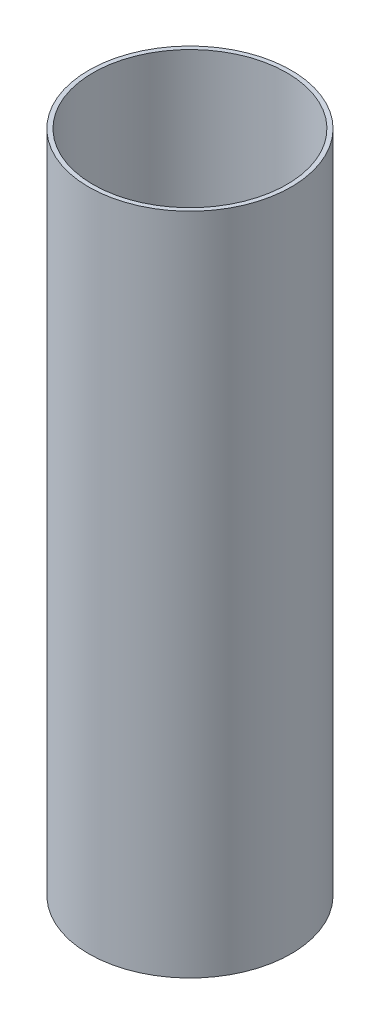
ISO-10303-21;
HEADER;
FILE_DESCRIPTION(('STEP AP214'),'2;1');
FILE_NAME('part.step','',(''),(''),'','','');
FILE_SCHEMA(('AUTOMOTIVE_DESIGN { 1 0 10303 214 1 1 1 1 }'));
ENDSEC;
DATA;
#1=APPLICATION_CONTEXT('core data for automotive mechanical design processes');
#2=APPLICATION_PROTOCOL_DEFINITION('international standard','automotive_design',2000,#1);
#3=PRODUCT_CONTEXT('',#1,'mechanical');
#4=PRODUCT('Part','Part','',(#3));
#5=PRODUCT_RELATED_PRODUCT_CATEGORY('part','',(#4));
#6=PRODUCT_DEFINITION_FORMATION('','',#4);
#7=PRODUCT_DEFINITION_CONTEXT('part definition',#1,'design');
#8=PRODUCT_DEFINITION('design','',#6,#7);
#9=PRODUCT_DEFINITION_SHAPE('','',#8);
#10=(LENGTH_UNIT() NAMED_UNIT(*) SI_UNIT(.MILLI.,.METRE.));
#11=(NAMED_UNIT(*) PLANE_ANGLE_UNIT() SI_UNIT($,.RADIAN.));
#12=(NAMED_UNIT(*) SI_UNIT($,.STERADIAN.) SOLID_ANGLE_UNIT());
#13=UNCERTAINTY_MEASURE_WITH_UNIT(LENGTH_MEASURE(1.E-05),#10,'distance_accuracy_value','');
#14=(GEOMETRIC_REPRESENTATION_CONTEXT(3) GLOBAL_UNCERTAINTY_ASSIGNED_CONTEXT((#13)) GLOBAL_UNIT_ASSIGNED_CONTEXT((#10,
#11,#12)) REPRESENTATION_CONTEXT('',''));
#15=CARTESIAN_POINT('',(0.,0.,0.));
#16=DIRECTION('',(0.,0.,1.));
#17=DIRECTION('',(1.,0.,0.));
#18=AXIS2_PLACEMENT_3D('',#15,#16,#17);
#19=CARTESIAN_POINT('',(0.,500.,0.));
#20=DIRECTION('',(0.,1.,0.));
#21=DIRECTION('',(0.,0.,1.));
#22=AXIS2_PLACEMENT_3D('',#19,#20,#21);
#23=PLANE('',#22);
#24=CARTESIAN_POINT('',(0.,500.,0.));
#25=DIRECTION('',(0.,1.,0.));
#26=DIRECTION('',(0.,0.,1.));
#27=AXIS2_PLACEMENT_3D('',#24,#25,#26);
#28=CIRCLE('',#27,76.2);
#29=CARTESIAN_POINT('',(0.,500.,76.2));
#30=VERTEX_POINT('',#29);
#31=EDGE_CURVE('E10',#30,#30,#28,.T.);
#32=ORIENTED_EDGE('',*,*,#31,.T.);
#33=EDGE_LOOP('',(#32));
#34=FACE_BOUND('',#33,.T.);
#35=CARTESIAN_POINT('',(0.,500.,0.));
#36=DIRECTION('',(0.,1.,0.));
#37=DIRECTION('',(0.,0.,1.));
#38=AXIS2_PLACEMENT_3D('',#35,#36,#37);
#39=CIRCLE('',#38,72.95);
#40=CARTESIAN_POINT('',(0.,500.,72.95));
#41=VERTEX_POINT('',#40);
#42=EDGE_CURVE('E56',#41,#41,#39,.T.);
#43=ORIENTED_EDGE('',*,*,#42,.F.);
#44=EDGE_LOOP('',(#43));
#45=FACE_BOUND('',#44,.T.);
#46=ADVANCED_FACE('F43',(#34,#45),#23,.T.);
#47=CARTESIAN_POINT('',(0.,0.,0.));
#48=DIRECTION('',(0.,1.,0.));
#49=DIRECTION('',(0.,0.,1.));
#50=AXIS2_PLACEMENT_3D('',#47,#48,#49);
#51=PLANE('',#50);
#52=CARTESIAN_POINT('',(0.,0.,0.));
#53=DIRECTION('',(0.,1.,0.));
#54=DIRECTION('',(0.,0.,1.));
#55=AXIS2_PLACEMENT_3D('',#52,#53,#54);
#56=CIRCLE('',#55,76.2);
#57=CARTESIAN_POINT('',(0.,0.,76.2));
#58=VERTEX_POINT('',#57);
#59=EDGE_CURVE('E47',#58,#58,#56,.T.);
#60=ORIENTED_EDGE('',*,*,#59,.F.);
#61=EDGE_LOOP('',(#60));
#62=FACE_BOUND('',#61,.T.);
#63=CARTESIAN_POINT('',(0.,0.,0.));
#64=DIRECTION('',(0.,1.,0.));
#65=DIRECTION('',(0.,0.,1.));
#66=AXIS2_PLACEMENT_3D('',#63,#64,#65);
#67=CIRCLE('',#66,72.95);
#68=CARTESIAN_POINT('',(0.,0.,72.95));
#69=VERTEX_POINT('',#68);
#70=EDGE_CURVE('E58',#69,#69,#67,.T.);
#71=ORIENTED_EDGE('',*,*,#70,.T.);
#72=EDGE_LOOP('',(#71));
#73=FACE_BOUND('',#72,.T.);
#74=ADVANCED_FACE('F70',(#62,#73),#51,.F.);
#75=CARTESIAN_POINT('',(0.,500.,0.));
#76=DIRECTION('',(0.,-1.,0.));
#77=DIRECTION('',(0.,0.,-1.));
#78=AXIS2_PLACEMENT_3D('',#75,#76,#77);
#79=CYLINDRICAL_SURFACE('',#78,76.2);
#80=ORIENTED_EDGE('',*,*,#31,.F.);
#81=EDGE_LOOP('',(#80));
#82=FACE_BOUND('',#81,.T.);
#83=ORIENTED_EDGE('',*,*,#59,.T.);
#84=EDGE_LOOP('',(#83));
#85=FACE_BOUND('',#84,.T.);
#86=ADVANCED_FACE('F45',(#82,#85),#79,.T.);
#87=CARTESIAN_POINT('',(0.,500.,0.));
#88=DIRECTION('',(0.,-1.,0.));
#89=DIRECTION('',(0.,0.,-1.));
#90=AXIS2_PLACEMENT_3D('',#87,#88,#89);
#91=CYLINDRICAL_SURFACE('',#90,72.95);
#92=ORIENTED_EDGE('',*,*,#42,.T.);
#93=EDGE_LOOP('',(#92));
#94=FACE_BOUND('',#93,.T.);
#95=ORIENTED_EDGE('',*,*,#70,.F.);
#96=EDGE_LOOP('',(#95));
#97=FACE_BOUND('',#96,.T.);
#98=ADVANCED_FACE('F66',(#94,#97),#91,.F.);
#99=CLOSED_SHELL('',(#46,#74,#86,#98));
#100=MANIFOLD_SOLID_BREP('B2',#99);
#101=ADVANCED_BREP_SHAPE_REPRESENTATION('',(#18,#100),#14);
#102=SHAPE_DEFINITION_REPRESENTATION(#9,#101);
ENDSEC;
END-ISO-10303-21;
